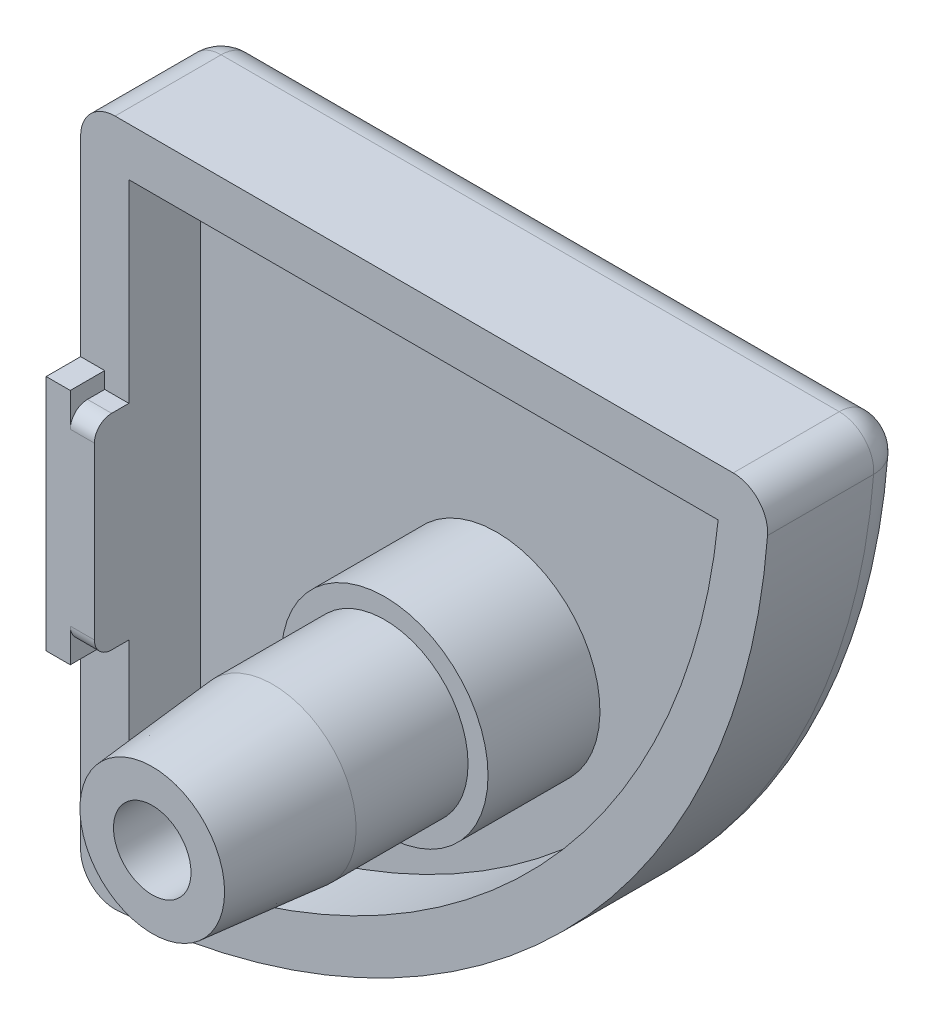
ISO-10303-21;
HEADER;
FILE_DESCRIPTION(('STEP AP214'),'2;1');
FILE_NAME('part.step','',(''),(''),'','','');
FILE_SCHEMA(('AUTOMOTIVE_DESIGN { 1 0 10303 214 1 1 1 1 }'));
ENDSEC;
DATA;
#1=APPLICATION_CONTEXT('core data for automotive mechanical design processes');
#2=APPLICATION_PROTOCOL_DEFINITION('international standard','automotive_design',2000,#1);
#3=PRODUCT_CONTEXT('',#1,'mechanical');
#4=PRODUCT('Part','Part','',(#3));
#5=PRODUCT_RELATED_PRODUCT_CATEGORY('part','',(#4));
#6=PRODUCT_DEFINITION_FORMATION('','',#4);
#7=PRODUCT_DEFINITION_CONTEXT('part definition',#1,'design');
#8=PRODUCT_DEFINITION('design','',#6,#7);
#9=PRODUCT_DEFINITION_SHAPE('','',#8);
#10=(LENGTH_UNIT() NAMED_UNIT(*) SI_UNIT(.MILLI.,.METRE.));
#11=(NAMED_UNIT(*) PLANE_ANGLE_UNIT() SI_UNIT($,.RADIAN.));
#12=(NAMED_UNIT(*) SI_UNIT($,.STERADIAN.) SOLID_ANGLE_UNIT());
#13=UNCERTAINTY_MEASURE_WITH_UNIT(LENGTH_MEASURE(1.E-05),#10,'distance_accuracy_value','');
#14=(GEOMETRIC_REPRESENTATION_CONTEXT(3) GLOBAL_UNCERTAINTY_ASSIGNED_CONTEXT((#13)) GLOBAL_UNIT_ASSIGNED_CONTEXT((#10,
#11,#12)) REPRESENTATION_CONTEXT('',''));
#15=CARTESIAN_POINT('',(0.,0.,0.));
#16=DIRECTION('',(0.,0.,1.));
#17=DIRECTION('',(1.,0.,0.));
#18=AXIS2_PLACEMENT_3D('',#15,#16,#17);
#19=CARTESIAN_POINT('',(10.,10.,5.25));
#20=DIRECTION('',(0.,0.,1.));
#21=DIRECTION('',(1.,0.,0.));
#22=AXIS2_PLACEMENT_3D('',#19,#20,#21);
#23=CYLINDRICAL_SURFACE('',#22,2.42);
#24=CARTESIAN_POINT('',(10.,10.,5.25));
#25=DIRECTION('',(0.,0.,1.));
#26=DIRECTION('',(1.,0.,0.));
#27=AXIS2_PLACEMENT_3D('',#24,#25,#26);
#28=CIRCLE('',#27,2.42);
#29=CARTESIAN_POINT('',(12.42,10.,5.25));
#30=VERTEX_POINT('',#29);
#31=EDGE_CURVE('E194',#30,#30,#28,.T.);
#32=ORIENTED_EDGE('',*,*,#31,.T.);
#33=EDGE_LOOP('',(#32));
#34=FACE_BOUND('',#33,.T.);
#35=CARTESIAN_POINT('',(10.,10.,8.5));
#36=DIRECTION('',(0.,0.,1.));
#37=DIRECTION('',(1.,0.,0.));
#38=AXIS2_PLACEMENT_3D('',#35,#36,#37);
#39=CIRCLE('',#38,2.42);
#40=CARTESIAN_POINT('',(12.42,10.,8.5));
#41=VERTEX_POINT('',#40);
#42=EDGE_CURVE('E800',#41,#41,#39,.T.);
#43=ORIENTED_EDGE('',*,*,#42,.F.);
#44=EDGE_LOOP('',(#43));
#45=FACE_BOUND('',#44,.T.);
#46=ADVANCED_FACE('F16',(#34,#45),#23,.T.);
#47=CARTESIAN_POINT('',(10.,10.,12.));
#48=DIRECTION('',(0.,0.,-1.));
#49=DIRECTION('',(-1.,0.,0.));
#50=AXIS2_PLACEMENT_3D('',#47,#48,#49);
#51=CYLINDRICAL_SURFACE('',#50,3.);
#52=CARTESIAN_POINT('',(10.,10.,2.));
#53=DIRECTION('',(0.,0.,-1.));
#54=DIRECTION('',(0.,1.,0.));
#55=AXIS2_PLACEMENT_3D('',#52,#53,#54);
#56=CIRCLE('',#55,3.);
#57=CARTESIAN_POINT('',(10.,13.,2.));
#58=VERTEX_POINT('',#57);
#59=EDGE_CURVE('E231',#58,#58,#56,.F.);
#60=ORIENTED_EDGE('',*,*,#59,.T.);
#61=EDGE_LOOP('',(#60));
#62=FACE_BOUND('',#61,.T.);
#63=CARTESIAN_POINT('',(10.,10.,5.25));
#64=DIRECTION('',(0.,0.,1.));
#65=DIRECTION('',(1.,0.,0.));
#66=AXIS2_PLACEMENT_3D('',#63,#64,#65);
#67=CIRCLE('',#66,3.);
#68=CARTESIAN_POINT('',(13.,10.,5.25));
#69=VERTEX_POINT('',#68);
#70=EDGE_CURVE('E198',#69,#69,#67,.T.);
#71=ORIENTED_EDGE('',*,*,#70,.F.);
#72=EDGE_LOOP('',(#71));
#73=FACE_BOUND('',#72,.T.);
#74=ADVANCED_FACE('F410',(#62,#73),#51,.T.);
#75=CARTESIAN_POINT('',(-0.494045930907676,20.4940459309077,4.08));
#76=DIRECTION('',(0.,0.,-1.));
#77=DIRECTION('',(-1.,0.,0.));
#78=AXIS2_PLACEMENT_3D('',#75,#76,#77);
#79=CYLINDRICAL_SURFACE('',#78,19.1);
#80=DIRECTION('',(0.,0.,-1.));
#81=VECTOR('',#80,1.);
#82=CARTESIAN_POINT('',(18.5118107983117,18.6,4.08));
#83=LINE('',#82,#81);
#84=CARTESIAN_POINT('',(18.5118107983117,18.6,4.08));
#85=VERTEX_POINT('',#84);
#86=CARTESIAN_POINT('',(18.5118107983117,18.6,2.));
#87=VERTEX_POINT('',#86);
#88=EDGE_CURVE('E220',#85,#87,#83,.T.);
#89=ORIENTED_EDGE('',*,*,#88,.T.);
#90=CARTESIAN_POINT('',(-0.494045930907676,20.4940459309077,2.));
#91=DIRECTION('',(0.,0.,-1.));
#92=DIRECTION('',(0.,1.,0.));
#93=AXIS2_PLACEMENT_3D('',#90,#91,#92);
#94=CIRCLE('',#93,19.1);
#95=CARTESIAN_POINT('',(1.4,1.48818920168834,2.));
#96=VERTEX_POINT('',#95);
#97=EDGE_CURVE('E199',#96,#87,#94,.F.);
#98=ORIENTED_EDGE('',*,*,#97,.F.);
#99=DIRECTION('',(0.,0.,-1.));
#100=VECTOR('',#99,1.);
#101=CARTESIAN_POINT('',(1.4,1.48818920168834,4.08));
#102=LINE('',#101,#100);
#103=CARTESIAN_POINT('',(1.4,1.48818920168834,4.08));
#104=VERTEX_POINT('',#103);
#105=EDGE_CURVE('E214',#104,#96,#102,.T.);
#106=ORIENTED_EDGE('',*,*,#105,.F.);
#107=CARTESIAN_POINT('',(-0.494045930907676,20.4940459309077,4.08));
#108=DIRECTION('',(0.,0.,1.));
#109=DIRECTION('',(1.,0.,0.));
#110=AXIS2_PLACEMENT_3D('',#107,#108,#109);
#111=CIRCLE('',#110,19.1);
#112=EDGE_CURVE('E201',#104,#85,#111,.T.);
#113=ORIENTED_EDGE('',*,*,#112,.T.);
#114=EDGE_LOOP('',(#89,#98,#106,#113));
#115=FACE_BOUND('',#114,.T.);
#116=ADVANCED_FACE('F416',(#115),#79,.F.);
#117=CARTESIAN_POINT('',(0.,18.6,4.08));
#118=DIRECTION('',(0.,-1.,0.));
#119=DIRECTION('',(0.,0.,-1.));
#120=AXIS2_PLACEMENT_3D('',#117,#118,#119);
#121=PLANE('',#120);
#122=DIRECTION('',(0.,0.,-1.));
#123=VECTOR('',#122,1.);
#124=CARTESIAN_POINT('',(1.4,18.6,4.08));
#125=LINE('',#124,#123);
#126=CARTESIAN_POINT('',(1.4,18.6,4.08));
#127=VERTEX_POINT('',#126);
#128=CARTESIAN_POINT('',(1.4,18.6,2.));
#129=VERTEX_POINT('',#128);
#130=EDGE_CURVE('E217',#127,#129,#125,.T.);
#131=ORIENTED_EDGE('',*,*,#130,.T.);
#132=DIRECTION('',(-1.,0.,0.));
#133=VECTOR('',#132,1.);
#134=CARTESIAN_POINT('',(20.001,18.6,2.));
#135=LINE('',#134,#133);
#136=EDGE_CURVE('E202',#87,#129,#135,.T.);
#137=ORIENTED_EDGE('',*,*,#136,.F.);
#138=ORIENTED_EDGE('',*,*,#88,.F.);
#139=DIRECTION('',(-1.,0.,0.));
#140=VECTOR('',#139,1.);
#141=CARTESIAN_POINT('',(0.,18.6,4.08));
#142=LINE('',#141,#140);
#143=EDGE_CURVE('E207',#85,#127,#142,.T.);
#144=ORIENTED_EDGE('',*,*,#143,.T.);
#145=EDGE_LOOP('',(#131,#137,#138,#144));
#146=FACE_BOUND('',#145,.T.);
#147=ADVANCED_FACE('F439',(#146),#121,.T.);
#148=CARTESIAN_POINT('',(1.4,0.,4.08));
#149=DIRECTION('',(1.,0.,0.));
#150=DIRECTION('',(0.,0.,-1.));
#151=AXIS2_PLACEMENT_3D('',#148,#149,#150);
#152=PLANE('',#151);
#153=DIRECTION('',(0.,1.,0.));
#154=VECTOR('',#153,1.);
#155=CARTESIAN_POINT('',(1.4,12.975,5.08));
#156=LINE('',#155,#154);
#157=CARTESIAN_POINT('',(1.4,7.525,5.08));
#158=VERTEX_POINT('',#157);
#159=CARTESIAN_POINT('',(1.4,12.475,5.08));
#160=VERTEX_POINT('',#159);
#161=EDGE_CURVE('E352',#158,#160,#156,.T.);
#162=ORIENTED_EDGE('',*,*,#161,.F.);
#163=CARTESIAN_POINT('',(1.4,7.525,4.58));
#164=DIRECTION('',(1.,0.,0.));
#165=DIRECTION('',(0.,0.,-1.));
#166=AXIS2_PLACEMENT_3D('',#163,#164,#165);
#167=CIRCLE('',#166,0.5);
#168=CARTESIAN_POINT('',(1.4,7.025,4.58));
#169=VERTEX_POINT('',#168);
#170=EDGE_CURVE('E244',#158,#169,#167,.T.);
#171=ORIENTED_EDGE('',*,*,#170,.T.);
#172=DIRECTION('',(0.,0.,-1.));
#173=VECTOR('',#172,1.);
#174=CARTESIAN_POINT('',(1.4,7.025,5.08));
#175=LINE('',#174,#173);
#176=CARTESIAN_POINT('',(1.4,7.025,4.08));
#177=VERTEX_POINT('',#176);
#178=EDGE_CURVE('E337',#169,#177,#175,.T.);
#179=ORIENTED_EDGE('',*,*,#178,.T.);
#180=DIRECTION('',(0.,-1.,0.));
#181=VECTOR('',#180,1.);
#182=CARTESIAN_POINT('',(1.4,0.,4.08));
#183=LINE('',#182,#181);
#184=EDGE_CURVE('E210',#177,#104,#183,.T.);
#185=ORIENTED_EDGE('',*,*,#184,.T.);
#186=ORIENTED_EDGE('',*,*,#105,.T.);
#187=DIRECTION('',(0.,-1.,0.));
#188=VECTOR('',#187,1.);
#189=CARTESIAN_POINT('',(1.4,18.6,2.));
#190=LINE('',#189,#188);
#191=EDGE_CURVE('E203',#129,#96,#190,.T.);
#192=ORIENTED_EDGE('',*,*,#191,.F.);
#193=ORIENTED_EDGE('',*,*,#130,.F.);
#194=CARTESIAN_POINT('',(1.4,12.975,4.08));
#195=VERTEX_POINT('',#194);
#196=EDGE_CURVE('E211',#127,#195,#183,.T.);
#197=ORIENTED_EDGE('',*,*,#196,.T.);
#198=DIRECTION('',(0.,0.,-1.));
#199=VECTOR('',#198,1.);
#200=CARTESIAN_POINT('',(1.4,12.975,5.08));
#201=LINE('',#200,#199);
#202=CARTESIAN_POINT('',(1.4,12.975,4.58));
#203=VERTEX_POINT('',#202);
#204=EDGE_CURVE('E335',#203,#195,#201,.T.);
#205=ORIENTED_EDGE('',*,*,#204,.F.);
#206=CARTESIAN_POINT('',(1.4,12.475,4.58));
#207=DIRECTION('',(1.,0.,0.));
#208=DIRECTION('',(0.,0.,-1.));
#209=AXIS2_PLACEMENT_3D('',#206,#207,#208);
#210=CIRCLE('',#209,0.5);
#211=EDGE_CURVE('E242',#203,#160,#210,.T.);
#212=ORIENTED_EDGE('',*,*,#211,.T.);
#213=EDGE_LOOP('',(#162,#171,#179,#185,#186,#192,#193,#197,#205,#212));
#214=FACE_BOUND('',#213,.T.);
#215=ADVANCED_FACE('F436',(#214),#152,.T.);
#216=CARTESIAN_POINT('',(-0.494045930907676,20.4940459309077,4.08));
#217=DIRECTION('',(0.,0.,1.));
#218=DIRECTION('',(1.,0.,0.));
#219=AXIS2_PLACEMENT_3D('',#216,#217,#218);
#220=PLANE('',#219);
#221=DIRECTION('',(-1.,0.,0.));
#222=VECTOR('',#221,1.);
#223=CARTESIAN_POINT('',(0.,20.,4.08));
#224=LINE('',#223,#222);
#225=CARTESIAN_POINT('',(18.9486346136144,20.,4.08));
#226=VERTEX_POINT('',#225);
#227=CARTESIAN_POINT('',(1.,20.,4.08));
#228=VERTEX_POINT('',#227);
#229=EDGE_CURVE('E226',#226,#228,#224,.T.);
#230=ORIENTED_EDGE('',*,*,#229,.T.);
#231=CARTESIAN_POINT('',(1.,19.,4.08));
#232=DIRECTION('',(0.,0.,1.));
#233=DIRECTION('',(1.,0.,0.));
#234=AXIS2_PLACEMENT_3D('',#231,#232,#233);
#235=CIRCLE('',#234,1.);
#236=CARTESIAN_POINT('',(0.,19.,4.08));
#237=VERTEX_POINT('',#236);
#238=EDGE_CURVE('E10',#228,#237,#235,.T.);
#239=ORIENTED_EDGE('',*,*,#238,.T.);
#240=DIRECTION('',(0.,-1.,0.));
#241=VECTOR('',#240,1.);
#242=CARTESIAN_POINT('',(0.,0.,4.08));
#243=LINE('',#242,#241);
#244=CARTESIAN_POINT('',(0.,13.45,4.08));
#245=VERTEX_POINT('',#244);
#246=EDGE_CURVE('E229',#237,#245,#243,.T.);
#247=ORIENTED_EDGE('',*,*,#246,.T.);
#248=DIRECTION('',(-1.,0.,0.));
#249=VECTOR('',#248,1.);
#250=CARTESIAN_POINT('',(0.,13.45,4.08));
#251=LINE('',#250,#249);
#252=CARTESIAN_POINT('',(0.7,13.45,4.08));
#253=VERTEX_POINT('',#252);
#254=EDGE_CURVE('E177',#253,#245,#251,.T.);
#255=ORIENTED_EDGE('',*,*,#254,.F.);
#256=DIRECTION('',(0.,1.,0.));
#257=VECTOR('',#256,1.);
#258=CARTESIAN_POINT('',(0.700000000000001,12.975,4.08));
#259=LINE('',#258,#257);
#260=CARTESIAN_POINT('',(0.700000000000001,12.975,4.08));
#261=VERTEX_POINT('',#260);
#262=EDGE_CURVE('E323',#261,#253,#259,.T.);
#263=ORIENTED_EDGE('',*,*,#262,.F.);
#264=DIRECTION('',(-1.,0.,0.));
#265=VECTOR('',#264,1.);
#266=CARTESIAN_POINT('',(1.4,12.975,4.08));
#267=LINE('',#266,#265);
#268=EDGE_CURVE('E320',#195,#261,#267,.T.);
#269=ORIENTED_EDGE('',*,*,#268,.F.);
#270=ORIENTED_EDGE('',*,*,#196,.F.);
#271=ORIENTED_EDGE('',*,*,#143,.F.);
#272=ORIENTED_EDGE('',*,*,#112,.F.);
#273=ORIENTED_EDGE('',*,*,#184,.F.);
#274=DIRECTION('',(1.,0.,0.));
#275=VECTOR('',#274,1.);
#276=CARTESIAN_POINT('',(1.4,7.025,4.08));
#277=LINE('',#276,#275);
#278=CARTESIAN_POINT('',(0.700000000000001,7.025,4.08));
#279=VERTEX_POINT('',#278);
#280=EDGE_CURVE('E313',#279,#177,#277,.T.);
#281=ORIENTED_EDGE('',*,*,#280,.F.);
#282=DIRECTION('',(0.,1.,0.));
#283=VECTOR('',#282,1.);
#284=CARTESIAN_POINT('',(0.700000000000001,7.025,4.08));
#285=LINE('',#284,#283);
#286=CARTESIAN_POINT('',(0.7,6.55,4.08));
#287=VERTEX_POINT('',#286);
#288=EDGE_CURVE('E310',#287,#279,#285,.T.);
#289=ORIENTED_EDGE('',*,*,#288,.F.);
#290=DIRECTION('',(1.,0.,0.));
#291=VECTOR('',#290,1.);
#292=CARTESIAN_POINT('',(0.,6.55,4.08));
#293=LINE('',#292,#291);
#294=CARTESIAN_POINT('',(0.,6.55,4.08));
#295=VERTEX_POINT('',#294);
#296=EDGE_CURVE('E308',#295,#287,#293,.T.);
#297=ORIENTED_EDGE('',*,*,#296,.F.);
#298=CARTESIAN_POINT('',(0.,1.05136538638558,4.08));
#299=VERTEX_POINT('',#298);
#300=EDGE_CURVE('E183',#295,#299,#243,.T.);
#301=ORIENTED_EDGE('',*,*,#300,.T.);
#302=CARTESIAN_POINT('',(1.,1.05136538638558,4.08));
#303=DIRECTION('',(0.,0.,1.));
#304=DIRECTION('',(1.,0.,0.));
#305=AXIS2_PLACEMENT_3D('',#302,#303,#304);
#306=CIRCLE('',#305,1.);
#307=CARTESIAN_POINT('',(1.07661774004655,0.054304845640854,4.08));
#308=VERTEX_POINT('',#307);
#309=EDGE_CURVE('E279',#299,#308,#306,.T.);
#310=ORIENTED_EDGE('',*,*,#309,.T.);
#311=CARTESIAN_POINT('',(-0.494045930907676,20.4940459309077,4.08));
#312=DIRECTION('',(0.,0.,1.));
#313=DIRECTION('',(1.,0.,0.));
#314=AXIS2_PLACEMENT_3D('',#311,#312,#313);
#315=CIRCLE('',#314,20.5);
#316=CARTESIAN_POINT('',(19.9456951543591,18.9233822599534,4.08));
#317=VERTEX_POINT('',#316);
#318=EDGE_CURVE('E223',#308,#317,#315,.T.);
#319=ORIENTED_EDGE('',*,*,#318,.T.);
#320=CARTESIAN_POINT('',(18.9486346136144,19.,4.08));
#321=DIRECTION('',(0.,0.,1.));
#322=DIRECTION('',(1.,0.,0.));
#323=AXIS2_PLACEMENT_3D('',#320,#321,#322);
#324=CIRCLE('',#323,1.);
#325=EDGE_CURVE('E25',#317,#226,#324,.T.);
#326=ORIENTED_EDGE('',*,*,#325,.T.);
#327=EDGE_LOOP('',(#230,#239,#247,#255,#263,#269,#270,#271,#272,#273,#281,#289,#297,#301,#310,
#319,#326));
#328=FACE_BOUND('',#327,.T.);
#329=ADVANCED_FACE('F348',(#328),#220,.T.);
#330=CARTESIAN_POINT('',(-0.494045930907676,20.4940459309077,0.));
#331=DIRECTION('',(0.,0.,1.));
#332=DIRECTION('',(1.,0.,0.));
#333=AXIS2_PLACEMENT_3D('',#330,#331,#332);
#334=PLANE('',#333);
#335=DIRECTION('',(0.,-1.,0.));
#336=VECTOR('',#335,1.);
#337=CARTESIAN_POINT('',(1.,20.4940459309077,0.));
#338=LINE('',#337,#336);
#339=CARTESIAN_POINT('',(1.,1.05136538638558,0.));
#340=VERTEX_POINT('',#339);
#341=CARTESIAN_POINT('',(1.,19.,0.));
#342=VERTEX_POINT('',#341);
#343=EDGE_CURVE('E264',#340,#342,#338,.F.);
#344=ORIENTED_EDGE('',*,*,#343,.T.);
#345=DIRECTION('',(-1.,0.,0.));
#346=VECTOR('',#345,1.);
#347=CARTESIAN_POINT('',(-0.494045930907676,19.,0.));
#348=LINE('',#347,#346);
#349=CARTESIAN_POINT('',(18.9486346136144,19.,0.));
#350=VERTEX_POINT('',#349);
#351=EDGE_CURVE('E266',#342,#350,#348,.F.);
#352=ORIENTED_EDGE('',*,*,#351,.T.);
#353=CARTESIAN_POINT('',(-0.494045930907676,20.4940459309077,0.));
#354=DIRECTION('',(0.,0.,1.));
#355=DIRECTION('',(1.,0.,0.));
#356=AXIS2_PLACEMENT_3D('',#353,#354,#355);
#357=CIRCLE('',#356,19.5);
#358=EDGE_CURVE('E262',#350,#340,#357,.F.);
#359=ORIENTED_EDGE('',*,*,#358,.T.);
#360=EDGE_LOOP('',(#344,#352,#359));
#361=FACE_BOUND('',#360,.T.);
#362=ADVANCED_FACE('F385',(#361),#334,.F.);
#363=CARTESIAN_POINT('',(-0.494045930907676,20.4940459309077,4.08));
#364=DIRECTION('',(0.,0.,-1.));
#365=DIRECTION('',(-1.,0.,0.));
#366=AXIS2_PLACEMENT_3D('',#363,#364,#365);
#367=CYLINDRICAL_SURFACE('',#366,20.5);
#368=CARTESIAN_POINT('',(-0.494045930907676,20.4940459309077,1.));
#369=DIRECTION('',(0.,0.,1.));
#370=DIRECTION('',(1.,0.,0.));
#371=AXIS2_PLACEMENT_3D('',#368,#369,#370);
#372=CIRCLE('',#371,20.5);
#373=CARTESIAN_POINT('',(1.07661774004655,0.054304845640855,1.));
#374=VERTEX_POINT('',#373);
#375=CARTESIAN_POINT('',(19.9456951543591,18.9233822599534,1.));
#376=VERTEX_POINT('',#375);
#377=EDGE_CURVE('E33',#374,#376,#372,.T.);
#378=ORIENTED_EDGE('',*,*,#377,.T.);
#379=DIRECTION('',(0.,0.,-1.));
#380=VECTOR('',#379,1.);
#381=CARTESIAN_POINT('',(19.9456951543591,18.9233822599534,4.08));
#382=LINE('',#381,#380);
#383=EDGE_CURVE('E277',#376,#317,#382,.F.);
#384=ORIENTED_EDGE('',*,*,#383,.T.);
#385=ORIENTED_EDGE('',*,*,#318,.F.);
#386=DIRECTION('',(0.,0.,-1.));
#387=VECTOR('',#386,1.);
#388=CARTESIAN_POINT('',(1.07661774004655,0.054304845640854,4.08));
#389=LINE('',#388,#387);
#390=EDGE_CURVE('E38',#308,#374,#389,.T.);
#391=ORIENTED_EDGE('',*,*,#390,.T.);
#392=EDGE_LOOP('',(#378,#384,#385,#391));
#393=FACE_BOUND('',#392,.T.);
#394=ADVANCED_FACE('F395',(#393),#367,.T.);
#395=CARTESIAN_POINT('',(0.,20.,4.08));
#396=DIRECTION('',(0.,-1.,0.));
#397=DIRECTION('',(0.,0.,-1.));
#398=AXIS2_PLACEMENT_3D('',#395,#396,#397);
#399=PLANE('',#398);
#400=DIRECTION('',(-1.,0.,0.));
#401=VECTOR('',#400,1.);
#402=CARTESIAN_POINT('',(0.,20.,1.));
#403=LINE('',#402,#401);
#404=CARTESIAN_POINT('',(18.9486346136144,20.,1.));
#405=VERTEX_POINT('',#404);
#406=CARTESIAN_POINT('',(1.,20.,1.));
#407=VERTEX_POINT('',#406);
#408=EDGE_CURVE('E257',#405,#407,#403,.T.);
#409=ORIENTED_EDGE('',*,*,#408,.T.);
#410=DIRECTION('',(0.,0.,-1.));
#411=VECTOR('',#410,1.);
#412=CARTESIAN_POINT('',(1.,20.,4.08));
#413=LINE('',#412,#411);
#414=EDGE_CURVE('E260',#407,#228,#413,.F.);
#415=ORIENTED_EDGE('',*,*,#414,.T.);
#416=ORIENTED_EDGE('',*,*,#229,.F.);
#417=DIRECTION('',(0.,0.,-1.));
#418=VECTOR('',#417,1.);
#419=CARTESIAN_POINT('',(18.9486346136144,20.,4.08));
#420=LINE('',#419,#418);
#421=EDGE_CURVE('E255',#226,#405,#420,.T.);
#422=ORIENTED_EDGE('',*,*,#421,.T.);
#423=EDGE_LOOP('',(#409,#415,#416,#422));
#424=FACE_BOUND('',#423,.T.);
#425=ADVANCED_FACE('F453',(#424),#399,.F.);
#426=CARTESIAN_POINT('',(0.,0.,4.08));
#427=DIRECTION('',(1.,0.,0.));
#428=DIRECTION('',(0.,0.,-1.));
#429=AXIS2_PLACEMENT_3D('',#426,#427,#428);
#430=PLANE('',#429);
#431=ORIENTED_EDGE('',*,*,#246,.F.);
#432=DIRECTION('',(0.,0.,-1.));
#433=VECTOR('',#432,1.);
#434=CARTESIAN_POINT('',(0.,19.,4.08));
#435=LINE('',#434,#433);
#436=CARTESIAN_POINT('',(0.,19.,1.));
#437=VERTEX_POINT('',#436);
#438=EDGE_CURVE('E273',#237,#437,#435,.T.);
#439=ORIENTED_EDGE('',*,*,#438,.T.);
#440=DIRECTION('',(0.,-1.,0.));
#441=VECTOR('',#440,1.);
#442=CARTESIAN_POINT('',(0.,0.,1.));
#443=LINE('',#442,#441);
#444=CARTESIAN_POINT('',(0.,1.05136538638558,1.));
#445=VERTEX_POINT('',#444);
#446=EDGE_CURVE('E271',#437,#445,#443,.T.);
#447=ORIENTED_EDGE('',*,*,#446,.T.);
#448=DIRECTION('',(0.,0.,-1.));
#449=VECTOR('',#448,1.);
#450=CARTESIAN_POINT('',(0.,1.05136538638558,4.08));
#451=LINE('',#450,#449);
#452=EDGE_CURVE('E269',#445,#299,#451,.F.);
#453=ORIENTED_EDGE('',*,*,#452,.T.);
#454=ORIENTED_EDGE('',*,*,#300,.F.);
#455=DIRECTION('',(0.,0.,-1.));
#456=VECTOR('',#455,1.);
#457=CARTESIAN_POINT('',(0.,6.55,5.08));
#458=LINE('',#457,#456);
#459=CARTESIAN_POINT('',(0.,6.55,5.08));
#460=VERTEX_POINT('',#459);
#461=EDGE_CURVE('E162',#460,#295,#458,.T.);
#462=ORIENTED_EDGE('',*,*,#461,.F.);
#463=DIRECTION('',(0.,-1.,0.));
#464=VECTOR('',#463,1.);
#465=CARTESIAN_POINT('',(0.,13.45,5.08));
#466=LINE('',#465,#464);
#467=CARTESIAN_POINT('',(0.,13.45,5.08));
#468=VERTEX_POINT('',#467);
#469=EDGE_CURVE('E168',#468,#460,#466,.T.);
#470=ORIENTED_EDGE('',*,*,#469,.F.);
#471=DIRECTION('',(0.,0.,-1.));
#472=VECTOR('',#471,1.);
#473=CARTESIAN_POINT('',(0.,13.45,5.08));
#474=LINE('',#473,#472);
#475=EDGE_CURVE('E328',#468,#245,#474,.T.);
#476=ORIENTED_EDGE('',*,*,#475,.T.);
#477=EDGE_LOOP('',(#431,#439,#447,#453,#454,#462,#470,#476));
#478=FACE_BOUND('',#477,.T.);
#479=ADVANCED_FACE('F181',(#478),#430,.F.);
#480=CARTESIAN_POINT('',(20.001,18.6,2.));
#481=DIRECTION('',(0.,0.,-1.));
#482=DIRECTION('',(0.,1.,0.));
#483=AXIS2_PLACEMENT_3D('',#480,#481,#482);
#484=PLANE('',#483);
#485=ORIENTED_EDGE('',*,*,#59,.F.);
#486=EDGE_LOOP('',(#485));
#487=FACE_BOUND('',#486,.T.);
#488=ORIENTED_EDGE('',*,*,#191,.T.);
#489=ORIENTED_EDGE('',*,*,#97,.T.);
#490=ORIENTED_EDGE('',*,*,#136,.T.);
#491=EDGE_LOOP('',(#488,#489,#490));
#492=FACE_BOUND('',#491,.T.);
#493=ADVANCED_FACE('F427',(#487,#492),#484,.F.);
#494=CARTESIAN_POINT('',(10.,10.,5.25));
#495=DIRECTION('',(0.,0.,1.));
#496=DIRECTION('',(1.,0.,0.));
#497=AXIS2_PLACEMENT_3D('',#494,#495,#496);
#498=PLANE('',#497);
#499=ORIENTED_EDGE('',*,*,#31,.F.);
#500=EDGE_LOOP('',(#499));
#501=FACE_BOUND('',#500,.T.);
#502=ORIENTED_EDGE('',*,*,#70,.T.);
#503=EDGE_LOOP('',(#502));
#504=FACE_BOUND('',#503,.T.);
#505=ADVANCED_FACE('F424',(#501,#504),#498,.T.);
#506=CARTESIAN_POINT('',(0.,6.55,5.08));
#507=DIRECTION('',(0.,1.,0.));
#508=DIRECTION('',(-1.,0.,0.));
#509=AXIS2_PLACEMENT_3D('',#506,#507,#508);
#510=PLANE('',#509);
#511=ORIENTED_EDGE('',*,*,#296,.T.);
#512=DIRECTION('',(0.,0.,-1.));
#513=VECTOR('',#512,1.);
#514=CARTESIAN_POINT('',(0.7,6.55,5.08));
#515=LINE('',#514,#513);
#516=CARTESIAN_POINT('',(0.7,6.55,5.08));
#517=VERTEX_POINT('',#516);
#518=EDGE_CURVE('E164',#517,#287,#515,.T.);
#519=ORIENTED_EDGE('',*,*,#518,.F.);
#520=DIRECTION('',(1.,0.,0.));
#521=VECTOR('',#520,1.);
#522=CARTESIAN_POINT('',(0.,6.55,5.08));
#523=LINE('',#522,#521);
#524=EDGE_CURVE('E157',#460,#517,#523,.T.);
#525=ORIENTED_EDGE('',*,*,#524,.F.);
#526=ORIENTED_EDGE('',*,*,#461,.T.);
#527=EDGE_LOOP('',(#511,#519,#525,#526));
#528=FACE_BOUND('',#527,.T.);
#529=ADVANCED_FACE('F160',(#528),#510,.F.);
#530=CARTESIAN_POINT('',(0.700000000000001,7.025,5.08));
#531=DIRECTION('',(-1.,0.,0.));
#532=DIRECTION('',(0.,-1.,0.));
#533=AXIS2_PLACEMENT_3D('',#530,#531,#532);
#534=PLANE('',#533);
#535=ORIENTED_EDGE('',*,*,#288,.T.);
#536=DIRECTION('',(0.,0.,-1.));
#537=VECTOR('',#536,1.);
#538=CARTESIAN_POINT('',(0.700000000000001,7.025,5.08));
#539=LINE('',#538,#537);
#540=CARTESIAN_POINT('',(0.700000000000001,7.025,4.58));
#541=VERTEX_POINT('',#540);
#542=EDGE_CURVE('E189',#541,#279,#539,.T.);
#543=ORIENTED_EDGE('',*,*,#542,.F.);
#544=CARTESIAN_POINT('',(0.700000000000001,7.525,4.58));
#545=DIRECTION('',(-1.,0.,0.));
#546=DIRECTION('',(0.,-1.,0.));
#547=AXIS2_PLACEMENT_3D('',#544,#545,#546);
#548=CIRCLE('',#547,0.5);
#549=CARTESIAN_POINT('',(0.700000000000001,7.525,5.08));
#550=VERTEX_POINT('',#549);
#551=EDGE_CURVE('E250',#541,#550,#548,.T.);
#552=ORIENTED_EDGE('',*,*,#551,.T.);
#553=DIRECTION('',(0.,1.,0.));
#554=VECTOR('',#553,1.);
#555=CARTESIAN_POINT('',(0.700000000000001,7.025,5.08));
#556=LINE('',#555,#554);
#557=EDGE_CURVE('E167',#517,#550,#556,.T.);
#558=ORIENTED_EDGE('',*,*,#557,.F.);
#559=ORIENTED_EDGE('',*,*,#518,.T.);
#560=EDGE_LOOP('',(#535,#543,#552,#558,#559));
#561=FACE_BOUND('',#560,.T.);
#562=ADVANCED_FACE('F350',(#561),#534,.F.);
#563=CARTESIAN_POINT('',(1.4,7.025,5.08));
#564=DIRECTION('',(0.,1.,0.));
#565=DIRECTION('',(0.,0.,1.));
#566=AXIS2_PLACEMENT_3D('',#563,#564,#565);
#567=PLANE('',#566);
#568=ORIENTED_EDGE('',*,*,#178,.F.);
#569=DIRECTION('',(1.,0.,0.));
#570=VECTOR('',#569,1.);
#571=CARTESIAN_POINT('',(0.700000000000001,7.025,4.58));
#572=LINE('',#571,#570);
#573=EDGE_CURVE('E246',#169,#541,#572,.F.);
#574=ORIENTED_EDGE('',*,*,#573,.T.);
#575=ORIENTED_EDGE('',*,*,#542,.T.);
#576=ORIENTED_EDGE('',*,*,#280,.T.);
#577=EDGE_LOOP('',(#568,#574,#575,#576));
#578=FACE_BOUND('',#577,.T.);
#579=ADVANCED_FACE('F342',(#578),#567,.F.);
#580=CARTESIAN_POINT('',(1.4,12.975,5.08));
#581=DIRECTION('',(0.,-1.,0.));
#582=DIRECTION('',(0.,0.,-1.));
#583=AXIS2_PLACEMENT_3D('',#580,#581,#582);
#584=PLANE('',#583);
#585=DIRECTION('',(0.,0.,-1.));
#586=VECTOR('',#585,1.);
#587=CARTESIAN_POINT('',(0.700000000000001,12.975,5.08));
#588=LINE('',#587,#586);
#589=CARTESIAN_POINT('',(0.700000000000001,12.975,4.58));
#590=VERTEX_POINT('',#589);
#591=EDGE_CURVE('E333',#590,#261,#588,.T.);
#592=ORIENTED_EDGE('',*,*,#591,.F.);
#593=DIRECTION('',(-1.,0.,0.));
#594=VECTOR('',#593,1.);
#595=CARTESIAN_POINT('',(1.4,12.975,4.58));
#596=LINE('',#595,#594);
#597=EDGE_CURVE('E248',#590,#203,#596,.F.);
#598=ORIENTED_EDGE('',*,*,#597,.T.);
#599=ORIENTED_EDGE('',*,*,#204,.T.);
#600=ORIENTED_EDGE('',*,*,#268,.T.);
#601=EDGE_LOOP('',(#592,#598,#599,#600));
#602=FACE_BOUND('',#601,.T.);
#603=ADVANCED_FACE('F637',(#602),#584,.F.);
#604=CARTESIAN_POINT('',(0.700000000000001,12.975,5.08));
#605=DIRECTION('',(-1.,0.,0.));
#606=DIRECTION('',(0.,-1.,0.));
#607=AXIS2_PLACEMENT_3D('',#604,#605,#606);
#608=PLANE('',#607);
#609=ORIENTED_EDGE('',*,*,#262,.T.);
#610=DIRECTION('',(0.,0.,-1.));
#611=VECTOR('',#610,1.);
#612=CARTESIAN_POINT('',(0.7,13.45,5.08));
#613=LINE('',#612,#611);
#614=CARTESIAN_POINT('',(0.7,13.45,5.08));
#615=VERTEX_POINT('',#614);
#616=EDGE_CURVE('E330',#615,#253,#613,.T.);
#617=ORIENTED_EDGE('',*,*,#616,.F.);
#618=DIRECTION('',(0.,1.,0.));
#619=VECTOR('',#618,1.);
#620=CARTESIAN_POINT('',(0.700000000000001,12.975,5.08));
#621=LINE('',#620,#619);
#622=CARTESIAN_POINT('',(0.700000000000001,12.475,5.08));
#623=VERTEX_POINT('',#622);
#624=EDGE_CURVE('E355',#623,#615,#621,.T.);
#625=ORIENTED_EDGE('',*,*,#624,.F.);
#626=CARTESIAN_POINT('',(0.700000000000001,12.475,4.58));
#627=DIRECTION('',(-1.,0.,0.));
#628=DIRECTION('',(0.,-1.,0.));
#629=AXIS2_PLACEMENT_3D('',#626,#627,#628);
#630=CIRCLE('',#629,0.5);
#631=EDGE_CURVE('E253',#623,#590,#630,.T.);
#632=ORIENTED_EDGE('',*,*,#631,.T.);
#633=ORIENTED_EDGE('',*,*,#591,.T.);
#634=EDGE_LOOP('',(#609,#617,#625,#632,#633));
#635=FACE_BOUND('',#634,.T.);
#636=ADVANCED_FACE('F361',(#635),#608,.F.);
#637=CARTESIAN_POINT('',(0.,13.45,5.08));
#638=DIRECTION('',(0.,-1.,0.));
#639=DIRECTION('',(0.,0.,-1.));
#640=AXIS2_PLACEMENT_3D('',#637,#638,#639);
#641=PLANE('',#640);
#642=ORIENTED_EDGE('',*,*,#254,.T.);
#643=ORIENTED_EDGE('',*,*,#475,.F.);
#644=DIRECTION('',(-1.,0.,0.));
#645=VECTOR('',#644,1.);
#646=CARTESIAN_POINT('',(0.,13.45,5.08));
#647=LINE('',#646,#645);
#648=EDGE_CURVE('E173',#615,#468,#647,.T.);
#649=ORIENTED_EDGE('',*,*,#648,.F.);
#650=ORIENTED_EDGE('',*,*,#616,.T.);
#651=EDGE_LOOP('',(#642,#643,#649,#650));
#652=FACE_BOUND('',#651,.T.);
#653=ADVANCED_FACE('F364',(#652),#641,.F.);
#654=CARTESIAN_POINT('',(0.,0.,5.08));
#655=DIRECTION('',(0.,0.,1.));
#656=DIRECTION('',(1.,0.,0.));
#657=AXIS2_PLACEMENT_3D('',#654,#655,#656);
#658=PLANE('',#657);
#659=ORIENTED_EDGE('',*,*,#557,.T.);
#660=DIRECTION('',(1.,0.,0.));
#661=VECTOR('',#660,1.);
#662=CARTESIAN_POINT('',(1.4,7.525,5.08));
#663=LINE('',#662,#661);
#664=EDGE_CURVE('E239',#550,#158,#663,.T.);
#665=ORIENTED_EDGE('',*,*,#664,.T.);
#666=ORIENTED_EDGE('',*,*,#161,.T.);
#667=DIRECTION('',(-1.,0.,0.));
#668=VECTOR('',#667,1.);
#669=CARTESIAN_POINT('',(0.700000000000001,12.475,5.08));
#670=LINE('',#669,#668);
#671=EDGE_CURVE('E234',#160,#623,#670,.T.);
#672=ORIENTED_EDGE('',*,*,#671,.T.);
#673=ORIENTED_EDGE('',*,*,#624,.T.);
#674=ORIENTED_EDGE('',*,*,#648,.T.);
#675=ORIENTED_EDGE('',*,*,#469,.T.);
#676=ORIENTED_EDGE('',*,*,#524,.T.);
#677=EDGE_LOOP('',(#659,#665,#666,#672,#673,#674,#675,#676));
#678=FACE_BOUND('',#677,.T.);
#679=ADVANCED_FACE('F171',(#678),#658,.T.);
#680=CARTESIAN_POINT('',(0.,7.525,4.58));
#681=DIRECTION('',(-1.,0.,0.));
#682=DIRECTION('',(0.,0.,1.));
#683=AXIS2_PLACEMENT_3D('',#680,#681,#682);
#684=CYLINDRICAL_SURFACE('',#683,0.5);
#685=ORIENTED_EDGE('',*,*,#551,.F.);
#686=ORIENTED_EDGE('',*,*,#573,.F.);
#687=ORIENTED_EDGE('',*,*,#170,.F.);
#688=ORIENTED_EDGE('',*,*,#664,.F.);
#689=EDGE_LOOP('',(#685,#686,#687,#688));
#690=FACE_BOUND('',#689,.T.);
#691=ADVANCED_FACE('F459',(#690),#684,.T.);
#692=CARTESIAN_POINT('',(0.,12.475,4.58));
#693=DIRECTION('',(1.,0.,0.));
#694=DIRECTION('',(0.,0.,-1.));
#695=AXIS2_PLACEMENT_3D('',#692,#693,#694);
#696=CYLINDRICAL_SURFACE('',#695,0.5);
#697=ORIENTED_EDGE('',*,*,#211,.F.);
#698=ORIENTED_EDGE('',*,*,#597,.F.);
#699=ORIENTED_EDGE('',*,*,#631,.F.);
#700=ORIENTED_EDGE('',*,*,#671,.F.);
#701=EDGE_LOOP('',(#697,#698,#699,#700));
#702=FACE_BOUND('',#701,.T.);
#703=ADVANCED_FACE('F408',(#702),#696,.T.);
#704=CARTESIAN_POINT('',(1.,1.05136538638558,4.08));
#705=DIRECTION('',(0.,0.,-1.));
#706=DIRECTION('',(-1.,0.,0.));
#707=AXIS2_PLACEMENT_3D('',#704,#705,#706);
#708=CYLINDRICAL_SURFACE('',#707,1.);
#709=CARTESIAN_POINT('',(1.,1.05136538638558,1.));
#710=DIRECTION('',(0.,0.,-1.));
#711=DIRECTION('',(-1.,0.,0.));
#712=AXIS2_PLACEMENT_3D('',#709,#710,#711);
#713=CIRCLE('',#712,1.);
#714=EDGE_CURVE('E20',#374,#445,#713,.T.);
#715=ORIENTED_EDGE('',*,*,#714,.F.);
#716=ORIENTED_EDGE('',*,*,#390,.F.);
#717=ORIENTED_EDGE('',*,*,#309,.F.);
#718=ORIENTED_EDGE('',*,*,#452,.F.);
#719=EDGE_LOOP('',(#715,#716,#717,#718));
#720=FACE_BOUND('',#719,.T.);
#721=ADVANCED_FACE('F18',(#720),#708,.T.);
#722=CARTESIAN_POINT('',(1.,1.05136538638558,1.));
#723=DIRECTION('',(0.,0.,1.));
#724=DIRECTION('',(1.,0.,0.));
#725=AXIS2_PLACEMENT_3D('',#722,#723,#724);
#726=SPHERICAL_SURFACE('',#725,1.);
#727=CARTESIAN_POINT('',(1.,1.05136538638558,1.));
#728=DIRECTION('',(0.,-1.,0.));
#729=DIRECTION('',(0.,0.,-1.));
#730=AXIS2_PLACEMENT_3D('',#727,#728,#729);
#731=CIRCLE('',#730,1.);
#732=EDGE_CURVE('E299',#340,#445,#731,.F.);
#733=ORIENTED_EDGE('',*,*,#732,.F.);
#734=CARTESIAN_POINT('',(1.,1.05136538638558,1.));
#735=DIRECTION('',(-0.997060540744723,-0.0766177400465473,0.));
#736=DIRECTION('',(0.0766177400465473,-0.997060540744723,0.));
#737=AXIS2_PLACEMENT_3D('',#734,#735,#736);
#738=CIRCLE('',#737,1.);
#739=EDGE_CURVE('E301',#374,#340,#738,.F.);
#740=ORIENTED_EDGE('',*,*,#739,.F.);
#741=ORIENTED_EDGE('',*,*,#714,.T.);
#742=EDGE_LOOP('',(#733,#740,#741));
#743=FACE_BOUND('',#742,.T.);
#744=ADVANCED_FACE('F400',(#743),#726,.T.);
#745=CARTESIAN_POINT('',(-0.494045930907676,20.4940459309077,1.));
#746=DIRECTION('',(0.,0.,1.));
#747=DIRECTION('',(1.,0.,0.));
#748=AXIS2_PLACEMENT_3D('',#745,#746,#747);
#749=TOROIDAL_SURFACE('',#748,19.5,1.);
#750=ORIENTED_EDGE('',*,*,#739,.T.);
#751=ORIENTED_EDGE('',*,*,#358,.F.);
#752=CARTESIAN_POINT('',(18.9486346136144,19.,1.));
#753=DIRECTION('',(0.0766177400465459,0.997060540744723,0.));
#754=DIRECTION('',(-0.997060540744723,0.0766177400465459,0.));
#755=AXIS2_PLACEMENT_3D('',#752,#753,#754);
#756=CIRCLE('',#755,1.);
#757=EDGE_CURVE('E296',#376,#350,#756,.T.);
#758=ORIENTED_EDGE('',*,*,#757,.F.);
#759=ORIENTED_EDGE('',*,*,#377,.F.);
#760=EDGE_LOOP('',(#750,#751,#758,#759));
#761=FACE_BOUND('',#760,.T.);
#762=ADVANCED_FACE('F387',(#761),#749,.T.);
#763=CARTESIAN_POINT('',(18.9486346136144,19.,4.08));
#764=DIRECTION('',(0.,0.,-1.));
#765=DIRECTION('',(-1.,0.,0.));
#766=AXIS2_PLACEMENT_3D('',#763,#764,#765);
#767=CYLINDRICAL_SURFACE('',#766,1.);
#768=ORIENTED_EDGE('',*,*,#325,.F.);
#769=ORIENTED_EDGE('',*,*,#383,.F.);
#770=CARTESIAN_POINT('',(18.9486346136144,19.,1.));
#771=DIRECTION('',(0.,0.,-1.));
#772=DIRECTION('',(-1.,0.,0.));
#773=AXIS2_PLACEMENT_3D('',#770,#771,#772);
#774=CIRCLE('',#773,1.);
#775=EDGE_CURVE('E293',#405,#376,#774,.T.);
#776=ORIENTED_EDGE('',*,*,#775,.F.);
#777=ORIENTED_EDGE('',*,*,#421,.F.);
#778=EDGE_LOOP('',(#768,#769,#776,#777));
#779=FACE_BOUND('',#778,.T.);
#780=ADVANCED_FACE('F394',(#779),#767,.T.);
#781=CARTESIAN_POINT('',(1.,19.,4.08));
#782=DIRECTION('',(0.,0.,-1.));
#783=DIRECTION('',(-1.,0.,0.));
#784=AXIS2_PLACEMENT_3D('',#781,#782,#783);
#785=CYLINDRICAL_SURFACE('',#784,1.);
#786=ORIENTED_EDGE('',*,*,#238,.F.);
#787=ORIENTED_EDGE('',*,*,#414,.F.);
#788=CARTESIAN_POINT('',(1.,19.,1.));
#789=DIRECTION('',(0.,0.,-1.));
#790=DIRECTION('',(-1.,0.,0.));
#791=AXIS2_PLACEMENT_3D('',#788,#789,#790);
#792=CIRCLE('',#791,1.);
#793=EDGE_CURVE('E290',#437,#407,#792,.T.);
#794=ORIENTED_EDGE('',*,*,#793,.F.);
#795=ORIENTED_EDGE('',*,*,#438,.F.);
#796=EDGE_LOOP('',(#786,#787,#794,#795));
#797=FACE_BOUND('',#796,.T.);
#798=ADVANCED_FACE('F370',(#797),#785,.T.);
#799=CARTESIAN_POINT('',(1.,0.,1.));
#800=DIRECTION('',(0.,-1.,0.));
#801=DIRECTION('',(0.,0.,-1.));
#802=AXIS2_PLACEMENT_3D('',#799,#800,#801);
#803=CYLINDRICAL_SURFACE('',#802,1.);
#804=ORIENTED_EDGE('',*,*,#732,.T.);
#805=ORIENTED_EDGE('',*,*,#446,.F.);
#806=CARTESIAN_POINT('',(1.,19.,1.));
#807=DIRECTION('',(0.,1.,0.));
#808=DIRECTION('',(0.,0.,1.));
#809=AXIS2_PLACEMENT_3D('',#806,#807,#808);
#810=CIRCLE('',#809,1.);
#811=EDGE_CURVE('E287',#342,#437,#810,.T.);
#812=ORIENTED_EDGE('',*,*,#811,.F.);
#813=ORIENTED_EDGE('',*,*,#343,.F.);
#814=EDGE_LOOP('',(#804,#805,#812,#813));
#815=FACE_BOUND('',#814,.T.);
#816=ADVANCED_FACE('F379',(#815),#803,.T.);
#817=CARTESIAN_POINT('',(18.9486346136144,19.,1.));
#818=DIRECTION('',(0.,0.,1.));
#819=DIRECTION('',(1.,0.,0.));
#820=AXIS2_PLACEMENT_3D('',#817,#818,#819);
#821=SPHERICAL_SURFACE('',#820,1.);
#822=ORIENTED_EDGE('',*,*,#775,.T.);
#823=ORIENTED_EDGE('',*,*,#757,.T.);
#824=CARTESIAN_POINT('',(18.9486346136144,19.,1.));
#825=DIRECTION('',(1.,0.,0.));
#826=DIRECTION('',(0.,0.,-1.));
#827=AXIS2_PLACEMENT_3D('',#824,#825,#826);
#828=CIRCLE('',#827,1.);
#829=EDGE_CURVE('E284',#405,#350,#828,.F.);
#830=ORIENTED_EDGE('',*,*,#829,.F.);
#831=EDGE_LOOP('',(#822,#823,#830));
#832=FACE_BOUND('',#831,.T.);
#833=ADVANCED_FACE('F390',(#832),#821,.T.);
#834=CARTESIAN_POINT('',(1.,19.,1.));
#835=DIRECTION('',(0.,0.,1.));
#836=DIRECTION('',(1.,0.,0.));
#837=AXIS2_PLACEMENT_3D('',#834,#835,#836);
#838=SPHERICAL_SURFACE('',#837,1.);
#839=ORIENTED_EDGE('',*,*,#811,.T.);
#840=ORIENTED_EDGE('',*,*,#793,.T.);
#841=CARTESIAN_POINT('',(1.,19.,1.));
#842=DIRECTION('',(-1.,0.,0.));
#843=DIRECTION('',(0.,0.,1.));
#844=AXIS2_PLACEMENT_3D('',#841,#842,#843);
#845=CIRCLE('',#844,1.);
#846=EDGE_CURVE('E282',#342,#407,#845,.F.);
#847=ORIENTED_EDGE('',*,*,#846,.F.);
#848=EDGE_LOOP('',(#839,#840,#847));
#849=FACE_BOUND('',#848,.T.);
#850=ADVANCED_FACE('F375',(#849),#838,.T.);
#851=CARTESIAN_POINT('',(0.,19.,1.));
#852=DIRECTION('',(-1.,0.,0.));
#853=DIRECTION('',(0.,0.,1.));
#854=AXIS2_PLACEMENT_3D('',#851,#852,#853);
#855=CYLINDRICAL_SURFACE('',#854,1.);
#856=ORIENTED_EDGE('',*,*,#829,.T.);
#857=ORIENTED_EDGE('',*,*,#351,.F.);
#858=ORIENTED_EDGE('',*,*,#846,.T.);
#859=ORIENTED_EDGE('',*,*,#408,.F.);
#860=EDGE_LOOP('',(#856,#857,#858,#859));
#861=FACE_BOUND('',#860,.T.);
#862=ADVANCED_FACE('F381',(#861),#855,.T.);
#863=CARTESIAN_POINT('',(10.,10.,12.));
#864=DIRECTION('',(0.,0.,-1.));
#865=DIRECTION('',(-1.,0.,0.));
#866=AXIS2_PLACEMENT_3D('',#863,#864,#865);
#867=CONICAL_SURFACE('',#866,2.1,0.091175085506527);
#868=ORIENTED_EDGE('',*,*,#42,.T.);
#869=EDGE_LOOP('',(#868));
#870=FACE_BOUND('',#869,.T.);
#871=CARTESIAN_POINT('',(10.,10.,12.));
#872=DIRECTION('',(0.,0.,1.));
#873=DIRECTION('',(1.,0.,0.));
#874=AXIS2_PLACEMENT_3D('',#871,#872,#873);
#875=CIRCLE('',#874,2.1);
#876=CARTESIAN_POINT('',(12.1,10.,12.));
#877=VERTEX_POINT('',#876);
#878=EDGE_CURVE('E285',#877,#877,#875,.T.);
#879=ORIENTED_EDGE('',*,*,#878,.F.);
#880=EDGE_LOOP('',(#879));
#881=FACE_BOUND('',#880,.T.);
#882=ADVANCED_FACE('F468',(#870,#881),#867,.T.);
#883=CARTESIAN_POINT('',(10.,10.,5.25));
#884=DIRECTION('',(0.,0.,1.));
#885=DIRECTION('',(1.,0.,0.));
#886=AXIS2_PLACEMENT_3D('',#883,#884,#885);
#887=PLANE('',#886);
#888=CARTESIAN_POINT('',(10.,10.,5.25));
#889=DIRECTION('',(0.,0.,1.));
#890=DIRECTION('',(1.,0.,0.));
#891=AXIS2_PLACEMENT_3D('',#888,#889,#890);
#892=CIRCLE('',#891,1.125);
#893=CARTESIAN_POINT('',(11.125,10.,5.25));
#894=VERTEX_POINT('',#893);
#895=EDGE_CURVE('E187',#894,#894,#892,.T.);
#896=ORIENTED_EDGE('',*,*,#895,.T.);
#897=EDGE_LOOP('',(#896));
#898=FACE_BOUND('',#897,.T.);
#899=ADVANCED_FACE('F510',(#898),#887,.T.);
#900=CARTESIAN_POINT('',(10.,10.,5.25));
#901=DIRECTION('',(0.,0.,1.));
#902=DIRECTION('',(1.,0.,0.));
#903=AXIS2_PLACEMENT_3D('',#900,#901,#902);
#904=CYLINDRICAL_SURFACE('',#903,1.125);
#905=ORIENTED_EDGE('',*,*,#895,.F.);
#906=EDGE_LOOP('',(#905));
#907=FACE_BOUND('',#906,.T.);
#908=CARTESIAN_POINT('',(10.,10.,12.));
#909=DIRECTION('',(0.,0.,1.));
#910=DIRECTION('',(1.,0.,0.));
#911=AXIS2_PLACEMENT_3D('',#908,#909,#910);
#912=CIRCLE('',#911,1.125);
#913=CARTESIAN_POINT('',(11.125,10.,12.));
#914=VERTEX_POINT('',#913);
#915=EDGE_CURVE('E184',#914,#914,#912,.T.);
#916=ORIENTED_EDGE('',*,*,#915,.T.);
#917=EDGE_LOOP('',(#916));
#918=FACE_BOUND('',#917,.T.);
#919=ADVANCED_FACE('F422',(#907,#918),#904,.F.);
#920=CARTESIAN_POINT('',(10.,10.,12.));
#921=DIRECTION('',(0.,0.,1.));
#922=DIRECTION('',(1.,0.,0.));
#923=AXIS2_PLACEMENT_3D('',#920,#921,#922);
#924=PLANE('',#923);
#925=ORIENTED_EDGE('',*,*,#915,.F.);
#926=EDGE_LOOP('',(#925));
#927=FACE_BOUND('',#926,.T.);
#928=ORIENTED_EDGE('',*,*,#878,.T.);
#929=EDGE_LOOP('',(#928));
#930=FACE_BOUND('',#929,.T.);
#931=ADVANCED_FACE('F429',(#927,#930),#924,.T.);
#932=CLOSED_SHELL('',(#46,#74,#116,#147,#215,#329,#362,#394,#425,#479,#493,#505,#529,#562,#579,
#603,#636,#653,#679,#691,#703,#721,#744,#762,#780,#798,#816,#833,#850,#862,#882,#899,#919,#931));
#933=MANIFOLD_SOLID_BREP('B1',#932);
#934=ADVANCED_BREP_SHAPE_REPRESENTATION('',(#18,#933),#14);
#935=SHAPE_DEFINITION_REPRESENTATION(#9,#934);
ENDSEC;
END-ISO-10303-21;
